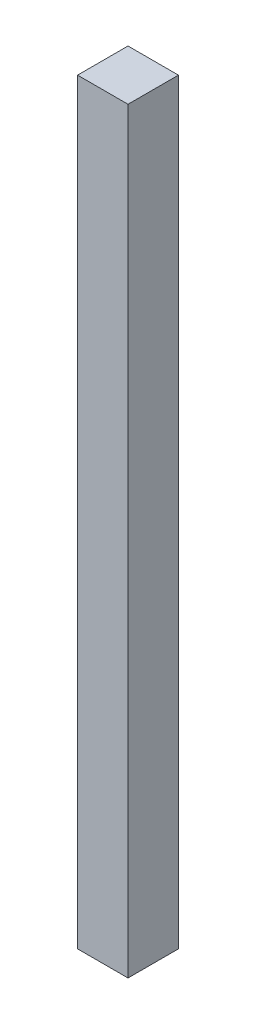
ISO-10303-21;
HEADER;
FILE_DESCRIPTION(('STEP AP214'),'2;1');
FILE_NAME('part.step','',(''),(''),'','','');
FILE_SCHEMA(('AUTOMOTIVE_DESIGN { 1 0 10303 214 1 1 1 1 }'));
ENDSEC;
DATA;
#1=APPLICATION_CONTEXT('core data for automotive mechanical design processes');
#2=APPLICATION_PROTOCOL_DEFINITION('international standard','automotive_design',2000,#1);
#3=PRODUCT_CONTEXT('',#1,'mechanical');
#4=PRODUCT('Part','Part','',(#3));
#5=PRODUCT_RELATED_PRODUCT_CATEGORY('part','',(#4));
#6=PRODUCT_DEFINITION_FORMATION('','',#4);
#7=PRODUCT_DEFINITION_CONTEXT('part definition',#1,'design');
#8=PRODUCT_DEFINITION('design','',#6,#7);
#9=PRODUCT_DEFINITION_SHAPE('','',#8);
#10=(LENGTH_UNIT() NAMED_UNIT(*) SI_UNIT(.MILLI.,.METRE.));
#11=(NAMED_UNIT(*) PLANE_ANGLE_UNIT() SI_UNIT($,.RADIAN.));
#12=(NAMED_UNIT(*) SI_UNIT($,.STERADIAN.) SOLID_ANGLE_UNIT());
#13=UNCERTAINTY_MEASURE_WITH_UNIT(LENGTH_MEASURE(1.E-05),#10,'distance_accuracy_value','');
#14=(GEOMETRIC_REPRESENTATION_CONTEXT(3) GLOBAL_UNCERTAINTY_ASSIGNED_CONTEXT((#13)) GLOBAL_UNIT_ASSIGNED_CONTEXT((#10,
#11,#12)) REPRESENTATION_CONTEXT('',''));
#15=CARTESIAN_POINT('',(0.,0.,0.));
#16=DIRECTION('',(0.,0.,1.));
#17=DIRECTION('',(1.,0.,0.));
#18=AXIS2_PLACEMENT_3D('',#15,#16,#17);
#19=CARTESIAN_POINT('',(-7.5,225.,-7.5));
#20=DIRECTION('',(1.,0.,0.));
#21=DIRECTION('',(0.,0.,-1.));
#22=AXIS2_PLACEMENT_3D('',#19,#20,#21);
#23=PLANE('',#22);
#24=DIRECTION('',(0.,0.,1.));
#25=VECTOR('',#24,1.);
#26=CARTESIAN_POINT('',(-7.5,0.,-7.5));
#27=LINE('',#26,#25);
#28=CARTESIAN_POINT('',(-7.5,0.,-7.5));
#29=VERTEX_POINT('',#28);
#30=CARTESIAN_POINT('',(-7.5,0.,7.5));
#31=VERTEX_POINT('',#30);
#32=EDGE_CURVE('E96',#29,#31,#27,.T.);
#33=ORIENTED_EDGE('',*,*,#32,.T.);
#34=DIRECTION('',(0.,-1.,0.));
#35=VECTOR('',#34,1.);
#36=CARTESIAN_POINT('',(-7.5,225.,7.5));
#37=LINE('',#36,#35);
#38=CARTESIAN_POINT('',(-7.5,225.,7.5));
#39=VERTEX_POINT('',#38);
#40=EDGE_CURVE('E11',#39,#31,#37,.T.);
#41=ORIENTED_EDGE('',*,*,#40,.F.);
#42=DIRECTION('',(0.,0.,1.));
#43=VECTOR('',#42,1.);
#44=CARTESIAN_POINT('',(-7.5,225.,-7.5));
#45=LINE('',#44,#43);
#46=CARTESIAN_POINT('',(-7.5,225.,-7.5));
#47=VERTEX_POINT('',#46);
#48=EDGE_CURVE('E84',#47,#39,#45,.T.);
#49=ORIENTED_EDGE('',*,*,#48,.F.);
#50=DIRECTION('',(0.,-1.,0.));
#51=VECTOR('',#50,1.);
#52=CARTESIAN_POINT('',(-7.5,225.,-7.5));
#53=LINE('',#52,#51);
#54=EDGE_CURVE('E92',#47,#29,#53,.T.);
#55=ORIENTED_EDGE('',*,*,#54,.T.);
#56=EDGE_LOOP('',(#33,#41,#49,#55));
#57=FACE_BOUND('',#56,.T.);
#58=ADVANCED_FACE('F33',(#57),#23,.F.);
#59=CARTESIAN_POINT('',(7.5,225.,7.5));
#60=DIRECTION('',(0.,0.,-1.));
#61=DIRECTION('',(-1.,0.,0.));
#62=AXIS2_PLACEMENT_3D('',#59,#60,#61);
#63=PLANE('',#62);
#64=DIRECTION('',(1.,0.,0.));
#65=VECTOR('',#64,1.);
#66=CARTESIAN_POINT('',(7.5,0.,7.5));
#67=LINE('',#66,#65);
#68=CARTESIAN_POINT('',(7.5,0.,7.5));
#69=VERTEX_POINT('',#68);
#70=EDGE_CURVE('E88',#31,#69,#67,.T.);
#71=ORIENTED_EDGE('',*,*,#70,.T.);
#72=DIRECTION('',(0.,-1.,0.));
#73=VECTOR('',#72,1.);
#74=CARTESIAN_POINT('',(7.5,225.,7.5));
#75=LINE('',#74,#73);
#76=CARTESIAN_POINT('',(7.5,225.,7.5));
#77=VERTEX_POINT('',#76);
#78=EDGE_CURVE('E41',#77,#69,#75,.T.);
#79=ORIENTED_EDGE('',*,*,#78,.F.);
#80=DIRECTION('',(1.,0.,0.));
#81=VECTOR('',#80,1.);
#82=CARTESIAN_POINT('',(7.5,225.,7.5));
#83=LINE('',#82,#81);
#84=EDGE_CURVE('E79',#39,#77,#83,.T.);
#85=ORIENTED_EDGE('',*,*,#84,.F.);
#86=ORIENTED_EDGE('',*,*,#40,.T.);
#87=EDGE_LOOP('',(#71,#79,#85,#86));
#88=FACE_BOUND('',#87,.T.);
#89=ADVANCED_FACE('F87',(#88),#63,.F.);
#90=CARTESIAN_POINT('',(7.5,225.,-7.5));
#91=DIRECTION('',(-1.,0.,0.));
#92=DIRECTION('',(0.,0.,1.));
#93=AXIS2_PLACEMENT_3D('',#90,#91,#92);
#94=PLANE('',#93);
#95=DIRECTION('',(0.,0.,-1.));
#96=VECTOR('',#95,1.);
#97=CARTESIAN_POINT('',(7.5,0.,-7.5));
#98=LINE('',#97,#96);
#99=CARTESIAN_POINT('',(7.5,0.,-7.5));
#100=VERTEX_POINT('',#99);
#101=EDGE_CURVE('E66',#69,#100,#98,.T.);
#102=ORIENTED_EDGE('',*,*,#101,.T.);
#103=DIRECTION('',(0.,-1.,0.));
#104=VECTOR('',#103,1.);
#105=CARTESIAN_POINT('',(7.5,225.,-7.5));
#106=LINE('',#105,#104);
#107=CARTESIAN_POINT('',(7.5,225.,-7.5));
#108=VERTEX_POINT('',#107);
#109=EDGE_CURVE('E89',#108,#100,#106,.T.);
#110=ORIENTED_EDGE('',*,*,#109,.F.);
#111=DIRECTION('',(0.,0.,-1.));
#112=VECTOR('',#111,1.);
#113=CARTESIAN_POINT('',(7.5,225.,-7.5));
#114=LINE('',#113,#112);
#115=EDGE_CURVE('E82',#77,#108,#114,.T.);
#116=ORIENTED_EDGE('',*,*,#115,.F.);
#117=ORIENTED_EDGE('',*,*,#78,.T.);
#118=EDGE_LOOP('',(#102,#110,#116,#117));
#119=FACE_BOUND('',#118,.T.);
#120=ADVANCED_FACE('F90',(#119),#94,.F.);
#121=CARTESIAN_POINT('',(7.5,225.,-7.5));
#122=DIRECTION('',(0.,0.,1.));
#123=DIRECTION('',(1.,0.,0.));
#124=AXIS2_PLACEMENT_3D('',#121,#122,#123);
#125=PLANE('',#124);
#126=DIRECTION('',(-1.,0.,0.));
#127=VECTOR('',#126,1.);
#128=CARTESIAN_POINT('',(7.5,0.,-7.5));
#129=LINE('',#128,#127);
#130=EDGE_CURVE('E72',#100,#29,#129,.T.);
#131=ORIENTED_EDGE('',*,*,#130,.T.);
#132=ORIENTED_EDGE('',*,*,#54,.F.);
#133=DIRECTION('',(-1.,0.,0.));
#134=VECTOR('',#133,1.);
#135=CARTESIAN_POINT('',(7.5,225.,-7.5));
#136=LINE('',#135,#134);
#137=EDGE_CURVE('E49',#108,#47,#136,.T.);
#138=ORIENTED_EDGE('',*,*,#137,.F.);
#139=ORIENTED_EDGE('',*,*,#109,.T.);
#140=EDGE_LOOP('',(#131,#132,#138,#139));
#141=FACE_BOUND('',#140,.T.);
#142=ADVANCED_FACE('F103',(#141),#125,.F.);
#143=CARTESIAN_POINT('',(0.,225.,0.));
#144=DIRECTION('',(0.,-1.,0.));
#145=DIRECTION('',(0.,0.,-1.));
#146=AXIS2_PLACEMENT_3D('',#143,#144,#145);
#147=PLANE('',#146);
#148=ORIENTED_EDGE('',*,*,#48,.T.);
#149=ORIENTED_EDGE('',*,*,#84,.T.);
#150=ORIENTED_EDGE('',*,*,#115,.T.);
#151=ORIENTED_EDGE('',*,*,#137,.T.);
#152=EDGE_LOOP('',(#148,#149,#150,#151));
#153=FACE_BOUND('',#152,.T.);
#154=ADVANCED_FACE('F80',(#153),#147,.F.);
#155=CARTESIAN_POINT('',(0.,0.,0.));
#156=DIRECTION('',(0.,-1.,0.));
#157=DIRECTION('',(0.,0.,-1.));
#158=AXIS2_PLACEMENT_3D('',#155,#156,#157);
#159=PLANE('',#158);
#160=ORIENTED_EDGE('',*,*,#32,.F.);
#161=ORIENTED_EDGE('',*,*,#130,.F.);
#162=ORIENTED_EDGE('',*,*,#101,.F.);
#163=ORIENTED_EDGE('',*,*,#70,.F.);
#164=EDGE_LOOP('',(#160,#161,#162,#163));
#165=FACE_BOUND('',#164,.T.);
#166=ADVANCED_FACE('F106',(#165),#159,.T.);
#167=CLOSED_SHELL('',(#58,#89,#120,#142,#154,#166));
#168=MANIFOLD_SOLID_BREP('B2',#167);
#169=ADVANCED_BREP_SHAPE_REPRESENTATION('',(#18,#168),#14);
#170=SHAPE_DEFINITION_REPRESENTATION(#9,#169);
ENDSEC;
END-ISO-10303-21;
